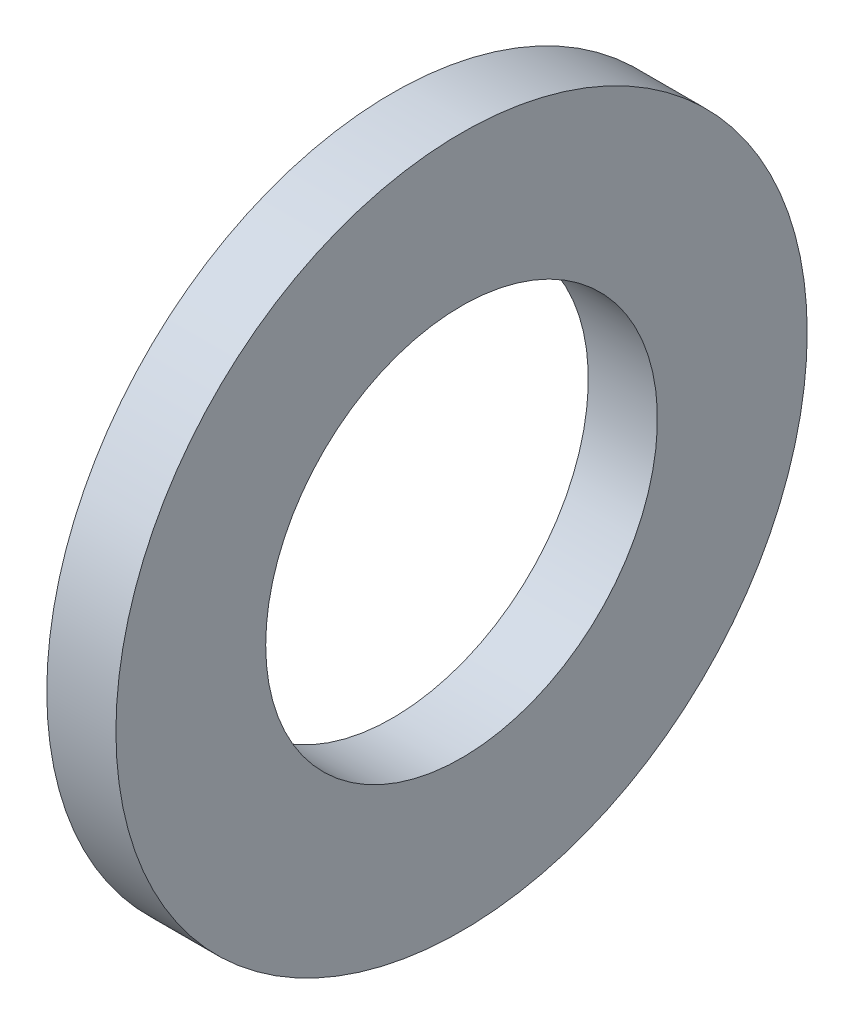
ISO-10303-21;
HEADER;
FILE_DESCRIPTION(('STEP AP214'),'2;1');
FILE_NAME('part.step','',(''),(''),'','','');
FILE_SCHEMA(('AUTOMOTIVE_DESIGN { 1 0 10303 214 1 1 1 1 }'));
ENDSEC;
DATA;
#1=APPLICATION_CONTEXT('core data for automotive mechanical design processes');
#2=APPLICATION_PROTOCOL_DEFINITION('international standard','automotive_design',2000,#1);
#3=PRODUCT_CONTEXT('',#1,'mechanical');
#4=PRODUCT('Part','Part','',(#3));
#5=PRODUCT_RELATED_PRODUCT_CATEGORY('part','',(#4));
#6=PRODUCT_DEFINITION_FORMATION('','',#4);
#7=PRODUCT_DEFINITION_CONTEXT('part definition',#1,'design');
#8=PRODUCT_DEFINITION('design','',#6,#7);
#9=PRODUCT_DEFINITION_SHAPE('','',#8);
#10=(LENGTH_UNIT() NAMED_UNIT(*) SI_UNIT(.MILLI.,.METRE.));
#11=(NAMED_UNIT(*) PLANE_ANGLE_UNIT() SI_UNIT($,.RADIAN.));
#12=(NAMED_UNIT(*) SI_UNIT($,.STERADIAN.) SOLID_ANGLE_UNIT());
#13=UNCERTAINTY_MEASURE_WITH_UNIT(LENGTH_MEASURE(1.E-05),#10,'distance_accuracy_value','');
#14=(GEOMETRIC_REPRESENTATION_CONTEXT(3) GLOBAL_UNCERTAINTY_ASSIGNED_CONTEXT((#13)) GLOBAL_UNIT_ASSIGNED_CONTEXT((#10,
#11,#12)) REPRESENTATION_CONTEXT('',''));
#15=CARTESIAN_POINT('',(0.,0.,0.));
#16=DIRECTION('',(0.,0.,1.));
#17=DIRECTION('',(1.,0.,0.));
#18=AXIS2_PLACEMENT_3D('',#15,#16,#17);
#19=CARTESIAN_POINT('',(-3.,15.,0.));
#20=DIRECTION('',(1.,0.,0.));
#21=DIRECTION('',(0.,0.,-1.));
#22=AXIS2_PLACEMENT_3D('',#19,#20,#21);
#23=PLANE('',#22);
#24=CARTESIAN_POINT('',(-3.,0.,0.));
#25=DIRECTION('',(-1.,0.,0.));
#26=DIRECTION('',(0.,0.,1.));
#27=AXIS2_PLACEMENT_3D('',#24,#25,#26);
#28=CIRCLE('',#27,15.);
#29=CARTESIAN_POINT('',(-3.,0.,15.));
#30=VERTEX_POINT('',#29);
#31=EDGE_CURVE('E17',#30,#30,#28,.F.);
#32=ORIENTED_EDGE('',*,*,#31,.F.);
#33=EDGE_LOOP('',(#32));
#34=FACE_BOUND('',#33,.T.);
#35=CARTESIAN_POINT('',(-3.,0.,0.));
#36=DIRECTION('',(-1.,0.,0.));
#37=DIRECTION('',(0.,0.,1.));
#38=AXIS2_PLACEMENT_3D('',#35,#36,#37);
#39=CIRCLE('',#38,8.5);
#40=CARTESIAN_POINT('',(-3.,0.,8.5));
#41=VERTEX_POINT('',#40);
#42=EDGE_CURVE('E26',#41,#41,#39,.F.);
#43=ORIENTED_EDGE('',*,*,#42,.T.);
#44=EDGE_LOOP('',(#43));
#45=FACE_BOUND('',#44,.T.);
#46=ADVANCED_FACE('F14',(#34,#45),#23,.F.);
#47=CARTESIAN_POINT('',(-34.9249999999999,0.,0.));
#48=DIRECTION('',(-1.,0.,0.));
#49=DIRECTION('',(0.,0.,1.));
#50=AXIS2_PLACEMENT_3D('',#47,#48,#49);
#51=CYLINDRICAL_SURFACE('',#50,15.);
#52=ORIENTED_EDGE('',*,*,#31,.T.);
#53=EDGE_LOOP('',(#52));
#54=FACE_BOUND('',#53,.T.);
#55=CARTESIAN_POINT('',(0.,0.,0.));
#56=DIRECTION('',(-1.,0.,0.));
#57=DIRECTION('',(0.,0.,1.));
#58=AXIS2_PLACEMENT_3D('',#55,#56,#57);
#59=CIRCLE('',#58,15.);
#60=CARTESIAN_POINT('',(0.,0.,15.));
#61=VERTEX_POINT('',#60);
#62=EDGE_CURVE('E21',#61,#61,#59,.T.);
#63=ORIENTED_EDGE('',*,*,#62,.T.);
#64=EDGE_LOOP('',(#63));
#65=FACE_BOUND('',#64,.T.);
#66=ADVANCED_FACE('F34',(#54,#65),#51,.T.);
#67=CARTESIAN_POINT('',(-34.9249999999999,0.,0.));
#68=DIRECTION('',(-1.,0.,0.));
#69=DIRECTION('',(0.,0.,1.));
#70=AXIS2_PLACEMENT_3D('',#67,#68,#69);
#71=CYLINDRICAL_SURFACE('',#70,8.5);
#72=CARTESIAN_POINT('',(0.,0.,0.));
#73=DIRECTION('',(-1.,0.,0.));
#74=DIRECTION('',(0.,0.,1.));
#75=AXIS2_PLACEMENT_3D('',#72,#73,#74);
#76=CIRCLE('',#75,8.5);
#77=CARTESIAN_POINT('',(0.,0.,8.5));
#78=VERTEX_POINT('',#77);
#79=EDGE_CURVE('E10',#78,#78,#76,.F.);
#80=ORIENTED_EDGE('',*,*,#79,.T.);
#81=EDGE_LOOP('',(#80));
#82=FACE_BOUND('',#81,.T.);
#83=ORIENTED_EDGE('',*,*,#42,.F.);
#84=EDGE_LOOP('',(#83));
#85=FACE_BOUND('',#84,.T.);
#86=ADVANCED_FACE('F42',(#82,#85),#71,.F.);
#87=CARTESIAN_POINT('',(0.,8.5,0.));
#88=DIRECTION('',(-1.,0.,0.));
#89=DIRECTION('',(0.,0.,1.));
#90=AXIS2_PLACEMENT_3D('',#87,#88,#89);
#91=PLANE('',#90);
#92=ORIENTED_EDGE('',*,*,#79,.F.);
#93=EDGE_LOOP('',(#92));
#94=FACE_BOUND('',#93,.T.);
#95=ORIENTED_EDGE('',*,*,#62,.F.);
#96=EDGE_LOOP('',(#95));
#97=FACE_BOUND('',#96,.T.);
#98=ADVANCED_FACE('F43',(#94,#97),#91,.F.);
#99=CLOSED_SHELL('',(#46,#66,#86,#98));
#100=MANIFOLD_SOLID_BREP('B1',#99);
#101=ADVANCED_BREP_SHAPE_REPRESENTATION('',(#18,#100),#14);
#102=SHAPE_DEFINITION_REPRESENTATION(#9,#101);
ENDSEC;
END-ISO-10303-21;
